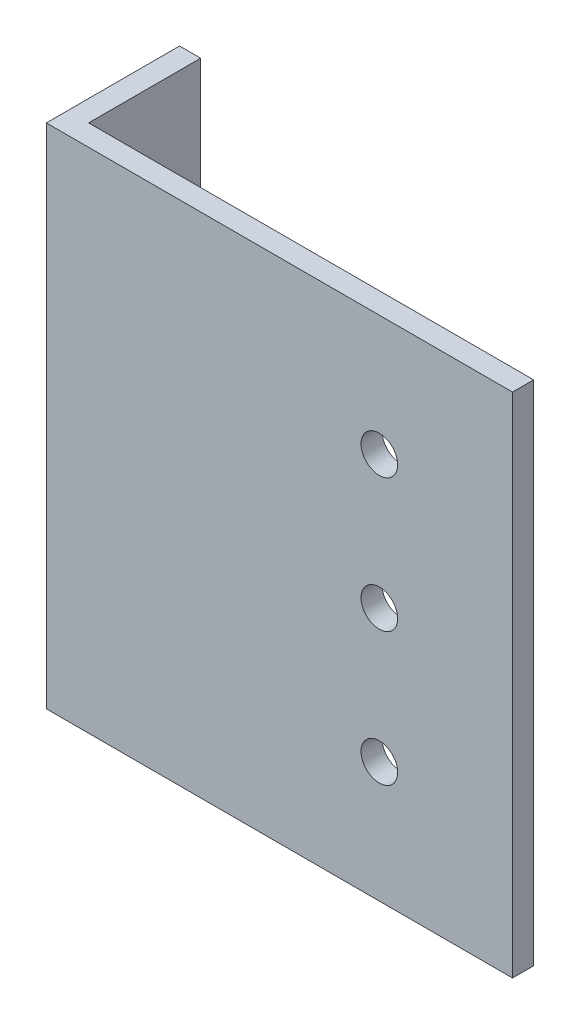
ISO-10303-21;
HEADER;
FILE_DESCRIPTION(('STEP AP214'),'2;1');
FILE_NAME('part.step','',(''),(''),'','','');
FILE_SCHEMA(('AUTOMOTIVE_DESIGN { 1 0 10303 214 1 1 1 1 }'));
ENDSEC;
DATA;
#1=APPLICATION_CONTEXT('core data for automotive mechanical design processes');
#2=APPLICATION_PROTOCOL_DEFINITION('international standard','automotive_design',2000,#1);
#3=PRODUCT_CONTEXT('',#1,'mechanical');
#4=PRODUCT('Part','Part','',(#3));
#5=PRODUCT_RELATED_PRODUCT_CATEGORY('part','',(#4));
#6=PRODUCT_DEFINITION_FORMATION('','',#4);
#7=PRODUCT_DEFINITION_CONTEXT('part definition',#1,'design');
#8=PRODUCT_DEFINITION('design','',#6,#7);
#9=PRODUCT_DEFINITION_SHAPE('','',#8);
#10=(LENGTH_UNIT() NAMED_UNIT(*) SI_UNIT(.MILLI.,.METRE.));
#11=(NAMED_UNIT(*) PLANE_ANGLE_UNIT() SI_UNIT($,.RADIAN.));
#12=(NAMED_UNIT(*) SI_UNIT($,.STERADIAN.) SOLID_ANGLE_UNIT());
#13=UNCERTAINTY_MEASURE_WITH_UNIT(LENGTH_MEASURE(1.E-05),#10,'distance_accuracy_value','');
#14=(GEOMETRIC_REPRESENTATION_CONTEXT(3) GLOBAL_UNCERTAINTY_ASSIGNED_CONTEXT((#13)) GLOBAL_UNIT_ASSIGNED_CONTEXT((#10,
#11,#12)) REPRESENTATION_CONTEXT('',''));
#15=CARTESIAN_POINT('',(0.,0.,0.));
#16=DIRECTION('',(0.,0.,1.));
#17=DIRECTION('',(1.,0.,0.));
#18=AXIS2_PLACEMENT_3D('',#15,#16,#17);
#19=CARTESIAN_POINT('',(0.,38.1,0.));
#20=DIRECTION('',(0.,0.,-1.));
#21=DIRECTION('',(-1.,0.,0.));
#22=AXIS2_PLACEMENT_3D('',#19,#20,#21);
#23=PLANE('',#22);
#24=CARTESIAN_POINT('',(50.,20.,0.));
#25=DIRECTION('',(0.,0.,1.));
#26=DIRECTION('',(1.,0.,0.));
#27=AXIS2_PLACEMENT_3D('',#24,#25,#26);
#28=CIRCLE('',#27,2.74999999999999);
#29=CARTESIAN_POINT('',(52.75,20.,0.));
#30=VERTEX_POINT('',#29);
#31=EDGE_CURVE('E150',#30,#30,#28,.T.);
#32=ORIENTED_EDGE('',*,*,#31,.F.);
#33=EDGE_LOOP('',(#32));
#34=FACE_BOUND('',#33,.T.);
#35=CARTESIAN_POINT('',(50.,0.,0.));
#36=DIRECTION('',(0.,0.,1.));
#37=DIRECTION('',(1.,0.,0.));
#38=AXIS2_PLACEMENT_3D('',#35,#36,#37);
#39=CIRCLE('',#38,2.74999999999999);
#40=CARTESIAN_POINT('',(52.75,0.,0.));
#41=VERTEX_POINT('',#40);
#42=EDGE_CURVE('E140',#41,#41,#39,.T.);
#43=ORIENTED_EDGE('',*,*,#42,.F.);
#44=EDGE_LOOP('',(#43));
#45=FACE_BOUND('',#44,.T.);
#46=CARTESIAN_POINT('',(50.,-20.,0.));
#47=DIRECTION('',(0.,0.,1.));
#48=DIRECTION('',(1.,0.,0.));
#49=AXIS2_PLACEMENT_3D('',#46,#47,#48);
#50=CIRCLE('',#49,2.74999999999999);
#51=CARTESIAN_POINT('',(52.75,-20.,0.));
#52=VERTEX_POINT('',#51);
#53=EDGE_CURVE('E137',#52,#52,#50,.T.);
#54=ORIENTED_EDGE('',*,*,#53,.F.);
#55=EDGE_LOOP('',(#54));
#56=FACE_BOUND('',#55,.T.);
#57=DIRECTION('',(1.,0.,0.));
#58=VECTOR('',#57,1.);
#59=CARTESIAN_POINT('',(0.,-38.1,0.));
#60=LINE('',#59,#58);
#61=CARTESIAN_POINT('',(0.,-38.1,0.));
#62=VERTEX_POINT('',#61);
#63=CARTESIAN_POINT('',(70.,-38.1,0.));
#64=VERTEX_POINT('',#63);
#65=EDGE_CURVE('E118',#62,#64,#60,.T.);
#66=ORIENTED_EDGE('',*,*,#65,.T.);
#67=DIRECTION('',(0.,-1.,0.));
#68=VECTOR('',#67,1.);
#69=CARTESIAN_POINT('',(70.,38.1,0.));
#70=LINE('',#69,#68);
#71=CARTESIAN_POINT('',(70.,38.1,0.));
#72=VERTEX_POINT('',#71);
#73=EDGE_CURVE('E11',#72,#64,#70,.T.);
#74=ORIENTED_EDGE('',*,*,#73,.F.);
#75=DIRECTION('',(1.,0.,0.));
#76=VECTOR('',#75,1.);
#77=CARTESIAN_POINT('',(0.,38.1,0.));
#78=LINE('',#77,#76);
#79=CARTESIAN_POINT('',(0.,38.1,0.));
#80=VERTEX_POINT('',#79);
#81=EDGE_CURVE('E83',#80,#72,#78,.T.);
#82=ORIENTED_EDGE('',*,*,#81,.F.);
#83=DIRECTION('',(0.,-1.,0.));
#84=VECTOR('',#83,1.);
#85=CARTESIAN_POINT('',(0.,38.1,0.));
#86=LINE('',#85,#84);
#87=EDGE_CURVE('E114',#80,#62,#86,.T.);
#88=ORIENTED_EDGE('',*,*,#87,.T.);
#89=EDGE_LOOP('',(#66,#74,#82,#88));
#90=FACE_BOUND('',#89,.T.);
#91=ADVANCED_FACE('F35',(#34,#45,#56,#90),#23,.F.);
#92=CARTESIAN_POINT('',(70.,38.1,-3.175));
#93=DIRECTION('',(1.,0.,0.));
#94=DIRECTION('',(0.,0.,-1.));
#95=AXIS2_PLACEMENT_3D('',#92,#93,#94);
#96=PLANE('',#95);
#97=DIRECTION('',(0.,0.,1.));
#98=VECTOR('',#97,1.);
#99=CARTESIAN_POINT('',(70.,-38.1,-3.175));
#100=LINE('',#99,#98);
#101=CARTESIAN_POINT('',(70.,-38.1,-3.175));
#102=VERTEX_POINT('',#101);
#103=EDGE_CURVE('E121',#102,#64,#100,.T.);
#104=ORIENTED_EDGE('',*,*,#103,.F.);
#105=DIRECTION('',(0.,-1.,0.));
#106=VECTOR('',#105,1.);
#107=CARTESIAN_POINT('',(70.,38.1,-3.175));
#108=LINE('',#107,#106);
#109=CARTESIAN_POINT('',(70.,38.1,-3.175));
#110=VERTEX_POINT('',#109);
#111=EDGE_CURVE('E44',#110,#102,#108,.T.);
#112=ORIENTED_EDGE('',*,*,#111,.F.);
#113=DIRECTION('',(0.,0.,1.));
#114=VECTOR('',#113,1.);
#115=CARTESIAN_POINT('',(70.,38.1,-3.175));
#116=LINE('',#115,#114);
#117=EDGE_CURVE('E155',#110,#72,#116,.T.);
#118=ORIENTED_EDGE('',*,*,#117,.T.);
#119=ORIENTED_EDGE('',*,*,#73,.T.);
#120=EDGE_LOOP('',(#104,#112,#118,#119));
#121=FACE_BOUND('',#120,.T.);
#122=ADVANCED_FACE('F179',(#121),#96,.T.);
#123=CARTESIAN_POINT('',(0.,38.1,-3.175));
#124=DIRECTION('',(0.,0.,-1.));
#125=DIRECTION('',(-1.,0.,0.));
#126=AXIS2_PLACEMENT_3D('',#123,#124,#125);
#127=PLANE('',#126);
#128=CARTESIAN_POINT('',(50.,20.,-3.175));
#129=DIRECTION('',(0.,0.,-1.));
#130=DIRECTION('',(-1.,0.,0.));
#131=AXIS2_PLACEMENT_3D('',#128,#129,#130);
#132=CIRCLE('',#131,2.74999999999999);
#133=CARTESIAN_POINT('',(47.25,20.,-3.175));
#134=VERTEX_POINT('',#133);
#135=EDGE_CURVE('E38',#134,#134,#132,.T.);
#136=ORIENTED_EDGE('',*,*,#135,.F.);
#137=EDGE_LOOP('',(#136));
#138=FACE_BOUND('',#137,.T.);
#139=CARTESIAN_POINT('',(50.,0.,-3.175));
#140=DIRECTION('',(0.,0.,-1.));
#141=DIRECTION('',(-1.,0.,0.));
#142=AXIS2_PLACEMENT_3D('',#139,#140,#141);
#143=CIRCLE('',#142,2.74999999999999);
#144=CARTESIAN_POINT('',(47.25,0.,-3.175));
#145=VERTEX_POINT('',#144);
#146=EDGE_CURVE('E138',#145,#145,#143,.T.);
#147=ORIENTED_EDGE('',*,*,#146,.F.);
#148=EDGE_LOOP('',(#147));
#149=FACE_BOUND('',#148,.T.);
#150=CARTESIAN_POINT('',(50.,-20.,-3.175));
#151=DIRECTION('',(0.,0.,-1.));
#152=DIRECTION('',(-1.,0.,0.));
#153=AXIS2_PLACEMENT_3D('',#150,#151,#152);
#154=CIRCLE('',#153,2.74999999999999);
#155=CARTESIAN_POINT('',(47.25,-20.,-3.175));
#156=VERTEX_POINT('',#155);
#157=EDGE_CURVE('E122',#156,#156,#154,.T.);
#158=ORIENTED_EDGE('',*,*,#157,.F.);
#159=EDGE_LOOP('',(#158));
#160=FACE_BOUND('',#159,.T.);
#161=DIRECTION('',(1.,0.,0.));
#162=VECTOR('',#161,1.);
#163=CARTESIAN_POINT('',(0.,-38.1,-3.175));
#164=LINE('',#163,#162);
#165=CARTESIAN_POINT('',(3.175,-38.1,-3.175));
#166=VERTEX_POINT('',#165);
#167=EDGE_CURVE('E125',#166,#102,#164,.T.);
#168=ORIENTED_EDGE('',*,*,#167,.F.);
#169=DIRECTION('',(0.,-1.,0.));
#170=VECTOR('',#169,1.);
#171=CARTESIAN_POINT('',(3.175,38.1,-3.175));
#172=LINE('',#171,#170);
#173=CARTESIAN_POINT('',(3.175,38.1,-3.175));
#174=VERTEX_POINT('',#173);
#175=EDGE_CURVE('E104',#174,#166,#172,.T.);
#176=ORIENTED_EDGE('',*,*,#175,.F.);
#177=DIRECTION('',(1.,0.,0.));
#178=VECTOR('',#177,1.);
#179=CARTESIAN_POINT('',(0.,38.1,-3.175));
#180=LINE('',#179,#178);
#181=EDGE_CURVE('E110',#174,#110,#180,.T.);
#182=ORIENTED_EDGE('',*,*,#181,.T.);
#183=ORIENTED_EDGE('',*,*,#111,.T.);
#184=EDGE_LOOP('',(#168,#176,#182,#183));
#185=FACE_BOUND('',#184,.T.);
#186=ADVANCED_FACE('F159',(#138,#149,#160,#185),#127,.T.);
#187=CARTESIAN_POINT('',(3.175,38.1,-20.));
#188=DIRECTION('',(1.,0.,0.));
#189=DIRECTION('',(0.,0.,-1.));
#190=AXIS2_PLACEMENT_3D('',#187,#188,#189);
#191=PLANE('',#190);
#192=CARTESIAN_POINT('',(3.175,20.,-14.));
#193=DIRECTION('',(1.,0.,0.));
#194=DIRECTION('',(0.,0.,-1.));
#195=AXIS2_PLACEMENT_3D('',#192,#193,#194);
#196=CIRCLE('',#195,2.75);
#197=CARTESIAN_POINT('',(3.175,20.,-16.75));
#198=VERTEX_POINT('',#197);
#199=EDGE_CURVE('E220',#198,#198,#196,.T.);
#200=ORIENTED_EDGE('',*,*,#199,.F.);
#201=EDGE_LOOP('',(#200));
#202=FACE_BOUND('',#201,.T.);
#203=CARTESIAN_POINT('',(3.175,-20.,-14.));
#204=DIRECTION('',(1.,0.,0.));
#205=DIRECTION('',(0.,0.,-1.));
#206=AXIS2_PLACEMENT_3D('',#203,#204,#205);
#207=CIRCLE('',#206,2.75);
#208=CARTESIAN_POINT('',(3.175,-20.,-16.75));
#209=VERTEX_POINT('',#208);
#210=EDGE_CURVE('E223',#209,#209,#207,.T.);
#211=ORIENTED_EDGE('',*,*,#210,.F.);
#212=EDGE_LOOP('',(#211));
#213=FACE_BOUND('',#212,.T.);
#214=DIRECTION('',(0.,0.,1.));
#215=VECTOR('',#214,1.);
#216=CARTESIAN_POINT('',(3.175,-38.1,-20.));
#217=LINE('',#216,#215);
#218=CARTESIAN_POINT('',(3.175,-38.1,-20.));
#219=VERTEX_POINT('',#218);
#220=EDGE_CURVE('E99',#219,#166,#217,.T.);
#221=ORIENTED_EDGE('',*,*,#220,.F.);
#222=DIRECTION('',(0.,-1.,0.));
#223=VECTOR('',#222,1.);
#224=CARTESIAN_POINT('',(3.175,38.1,-20.));
#225=LINE('',#224,#223);
#226=CARTESIAN_POINT('',(3.175,38.1,-20.));
#227=VERTEX_POINT('',#226);
#228=EDGE_CURVE('E94',#227,#219,#225,.T.);
#229=ORIENTED_EDGE('',*,*,#228,.F.);
#230=DIRECTION('',(0.,0.,1.));
#231=VECTOR('',#230,1.);
#232=CARTESIAN_POINT('',(3.175,38.1,-20.));
#233=LINE('',#232,#231);
#234=EDGE_CURVE('E97',#227,#174,#233,.T.);
#235=ORIENTED_EDGE('',*,*,#234,.T.);
#236=ORIENTED_EDGE('',*,*,#175,.T.);
#237=EDGE_LOOP('',(#221,#229,#235,#236));
#238=FACE_BOUND('',#237,.T.);
#239=ADVANCED_FACE('F96',(#202,#213,#238),#191,.T.);
#240=CARTESIAN_POINT('',(0.,38.1,-20.));
#241=DIRECTION('',(0.,0.,-1.));
#242=DIRECTION('',(-1.,0.,0.));
#243=AXIS2_PLACEMENT_3D('',#240,#241,#242);
#244=PLANE('',#243);
#245=DIRECTION('',(1.,0.,0.));
#246=VECTOR('',#245,1.);
#247=CARTESIAN_POINT('',(0.,-38.1,-20.));
#248=LINE('',#247,#246);
#249=CARTESIAN_POINT('',(0.,-38.1,-20.));
#250=VERTEX_POINT('',#249);
#251=EDGE_CURVE('E129',#250,#219,#248,.T.);
#252=ORIENTED_EDGE('',*,*,#251,.F.);
#253=DIRECTION('',(0.,-1.,0.));
#254=VECTOR('',#253,1.);
#255=CARTESIAN_POINT('',(0.,38.1,-20.));
#256=LINE('',#255,#254);
#257=CARTESIAN_POINT('',(0.,38.1,-20.));
#258=VERTEX_POINT('',#257);
#259=EDGE_CURVE('E74',#258,#250,#256,.T.);
#260=ORIENTED_EDGE('',*,*,#259,.F.);
#261=DIRECTION('',(1.,0.,0.));
#262=VECTOR('',#261,1.);
#263=CARTESIAN_POINT('',(0.,38.1,-20.));
#264=LINE('',#263,#262);
#265=EDGE_CURVE('E108',#258,#227,#264,.T.);
#266=ORIENTED_EDGE('',*,*,#265,.T.);
#267=ORIENTED_EDGE('',*,*,#228,.T.);
#268=EDGE_LOOP('',(#252,#260,#266,#267));
#269=FACE_BOUND('',#268,.T.);
#270=ADVANCED_FACE('F112',(#269),#244,.T.);
#271=CARTESIAN_POINT('',(0.,38.1,-20.));
#272=DIRECTION('',(1.,0.,0.));
#273=DIRECTION('',(0.,0.,-1.));
#274=AXIS2_PLACEMENT_3D('',#271,#272,#273);
#275=PLANE('',#274);
#276=CARTESIAN_POINT('',(0.,20.,-14.));
#277=DIRECTION('',(1.,0.,0.));
#278=DIRECTION('',(0.,0.,-1.));
#279=AXIS2_PLACEMENT_3D('',#276,#277,#278);
#280=CIRCLE('',#279,2.75);
#281=CARTESIAN_POINT('',(0.,20.,-16.75));
#282=VERTEX_POINT('',#281);
#283=EDGE_CURVE('E217',#282,#282,#280,.T.);
#284=ORIENTED_EDGE('',*,*,#283,.T.);
#285=EDGE_LOOP('',(#284));
#286=FACE_BOUND('',#285,.T.);
#287=CARTESIAN_POINT('',(0.,-20.,-14.));
#288=DIRECTION('',(1.,0.,0.));
#289=DIRECTION('',(0.,0.,-1.));
#290=AXIS2_PLACEMENT_3D('',#287,#288,#289);
#291=CIRCLE('',#290,2.75);
#292=CARTESIAN_POINT('',(0.,-20.,-16.75));
#293=VERTEX_POINT('',#292);
#294=EDGE_CURVE('E227',#293,#293,#291,.T.);
#295=ORIENTED_EDGE('',*,*,#294,.T.);
#296=EDGE_LOOP('',(#295));
#297=FACE_BOUND('',#296,.T.);
#298=DIRECTION('',(0.,0.,1.));
#299=VECTOR('',#298,1.);
#300=CARTESIAN_POINT('',(0.,-38.1,-20.));
#301=LINE('',#300,#299);
#302=EDGE_CURVE('E77',#250,#62,#301,.T.);
#303=ORIENTED_EDGE('',*,*,#302,.T.);
#304=ORIENTED_EDGE('',*,*,#87,.F.);
#305=DIRECTION('',(0.,0.,1.));
#306=VECTOR('',#305,1.);
#307=CARTESIAN_POINT('',(0.,38.1,-20.));
#308=LINE('',#307,#306);
#309=EDGE_CURVE('E53',#258,#80,#308,.T.);
#310=ORIENTED_EDGE('',*,*,#309,.F.);
#311=ORIENTED_EDGE('',*,*,#259,.T.);
#312=EDGE_LOOP('',(#303,#304,#310,#311));
#313=FACE_BOUND('',#312,.T.);
#314=ADVANCED_FACE('F165',(#286,#297,#313),#275,.F.);
#315=CARTESIAN_POINT('',(0.,38.1,0.));
#316=DIRECTION('',(0.,-1.,0.));
#317=DIRECTION('',(-1.,0.,0.));
#318=AXIS2_PLACEMENT_3D('',#315,#316,#317);
#319=PLANE('',#318);
#320=ORIENTED_EDGE('',*,*,#81,.T.);
#321=ORIENTED_EDGE('',*,*,#117,.F.);
#322=ORIENTED_EDGE('',*,*,#181,.F.);
#323=ORIENTED_EDGE('',*,*,#234,.F.);
#324=ORIENTED_EDGE('',*,*,#265,.F.);
#325=ORIENTED_EDGE('',*,*,#309,.T.);
#326=EDGE_LOOP('',(#320,#321,#322,#323,#324,#325));
#327=FACE_BOUND('',#326,.T.);
#328=ADVANCED_FACE('F107',(#327),#319,.F.);
#329=CARTESIAN_POINT('',(0.,-38.1,0.));
#330=DIRECTION('',(0.,-1.,0.));
#331=DIRECTION('',(-1.,0.,0.));
#332=AXIS2_PLACEMENT_3D('',#329,#330,#331);
#333=PLANE('',#332);
#334=ORIENTED_EDGE('',*,*,#65,.F.);
#335=ORIENTED_EDGE('',*,*,#302,.F.);
#336=ORIENTED_EDGE('',*,*,#251,.T.);
#337=ORIENTED_EDGE('',*,*,#220,.T.);
#338=ORIENTED_EDGE('',*,*,#167,.T.);
#339=ORIENTED_EDGE('',*,*,#103,.T.);
#340=EDGE_LOOP('',(#334,#335,#336,#337,#338,#339));
#341=FACE_BOUND('',#340,.T.);
#342=ADVANCED_FACE('F163',(#341),#333,.T.);
#343=CARTESIAN_POINT('',(50.,-20.,0.));
#344=DIRECTION('',(0.,0.,1.));
#345=DIRECTION('',(1.,0.,0.));
#346=AXIS2_PLACEMENT_3D('',#343,#344,#345);
#347=CYLINDRICAL_SURFACE('',#346,2.74999999999999);
#348=ORIENTED_EDGE('',*,*,#157,.T.);
#349=EDGE_LOOP('',(#348));
#350=FACE_BOUND('',#349,.T.);
#351=ORIENTED_EDGE('',*,*,#53,.T.);
#352=EDGE_LOOP('',(#351));
#353=FACE_BOUND('',#352,.T.);
#354=ADVANCED_FACE('F191',(#350,#353),#347,.F.);
#355=CARTESIAN_POINT('',(50.,0.,0.));
#356=DIRECTION('',(0.,0.,1.));
#357=DIRECTION('',(1.,0.,0.));
#358=AXIS2_PLACEMENT_3D('',#355,#356,#357);
#359=CYLINDRICAL_SURFACE('',#358,2.74999999999999);
#360=ORIENTED_EDGE('',*,*,#146,.T.);
#361=EDGE_LOOP('',(#360));
#362=FACE_BOUND('',#361,.T.);
#363=ORIENTED_EDGE('',*,*,#42,.T.);
#364=EDGE_LOOP('',(#363));
#365=FACE_BOUND('',#364,.T.);
#366=ADVANCED_FACE('F193',(#362,#365),#359,.F.);
#367=CARTESIAN_POINT('',(50.,20.,0.));
#368=DIRECTION('',(0.,0.,1.));
#369=DIRECTION('',(1.,0.,0.));
#370=AXIS2_PLACEMENT_3D('',#367,#368,#369);
#371=CYLINDRICAL_SURFACE('',#370,2.74999999999999);
#372=ORIENTED_EDGE('',*,*,#135,.T.);
#373=EDGE_LOOP('',(#372));
#374=FACE_BOUND('',#373,.T.);
#375=ORIENTED_EDGE('',*,*,#31,.T.);
#376=EDGE_LOOP('',(#375));
#377=FACE_BOUND('',#376,.T.);
#378=ADVANCED_FACE('F200',(#374,#377),#371,.F.);
#379=CARTESIAN_POINT('',(3.175,-20.,-14.));
#380=DIRECTION('',(1.,0.,0.));
#381=DIRECTION('',(0.,0.,-1.));
#382=AXIS2_PLACEMENT_3D('',#379,#380,#381);
#383=CYLINDRICAL_SURFACE('',#382,2.75);
#384=ORIENTED_EDGE('',*,*,#294,.F.);
#385=EDGE_LOOP('',(#384));
#386=FACE_BOUND('',#385,.T.);
#387=ORIENTED_EDGE('',*,*,#210,.T.);
#388=EDGE_LOOP('',(#387));
#389=FACE_BOUND('',#388,.T.);
#390=ADVANCED_FACE('F205',(#386,#389),#383,.F.);
#391=CARTESIAN_POINT('',(3.175,20.,-14.));
#392=DIRECTION('',(1.,0.,0.));
#393=DIRECTION('',(0.,0.,-1.));
#394=AXIS2_PLACEMENT_3D('',#391,#392,#393);
#395=CYLINDRICAL_SURFACE('',#394,2.75);
#396=ORIENTED_EDGE('',*,*,#283,.F.);
#397=EDGE_LOOP('',(#396));
#398=FACE_BOUND('',#397,.T.);
#399=ORIENTED_EDGE('',*,*,#199,.T.);
#400=EDGE_LOOP('',(#399));
#401=FACE_BOUND('',#400,.T.);
#402=ADVANCED_FACE('F209',(#398,#401),#395,.F.);
#403=CLOSED_SHELL('',(#91,#122,#186,#239,#270,#314,#328,#342,#354,#366,#378,#390,#402));
#404=MANIFOLD_SOLID_BREP('B2',#403);
#405=ADVANCED_BREP_SHAPE_REPRESENTATION('',(#18,#404),#14);
#406=SHAPE_DEFINITION_REPRESENTATION(#9,#405);
ENDSEC;
END-ISO-10303-21;
